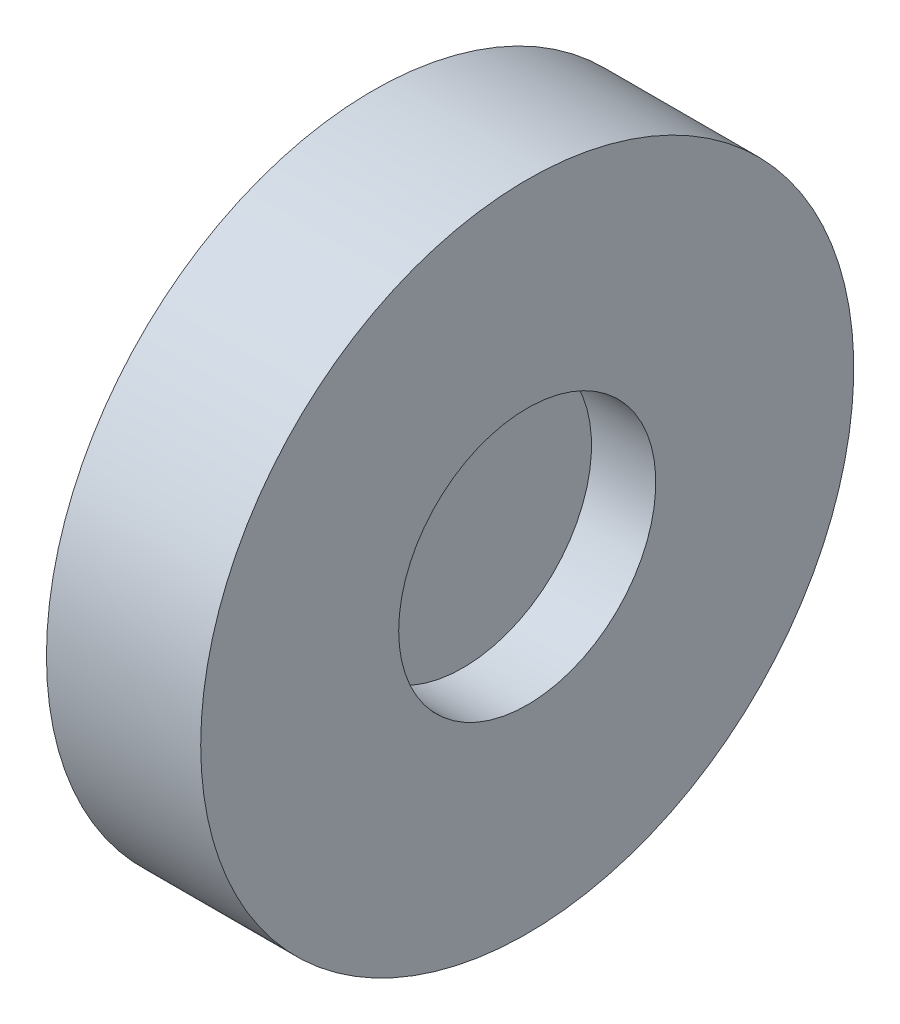
ISO-10303-21;
HEADER;
FILE_DESCRIPTION(('STEP AP214'),'2;1');
FILE_NAME('part.step','',(''),(''),'','','');
FILE_SCHEMA(('AUTOMOTIVE_DESIGN { 1 0 10303 214 1 1 1 1 }'));
ENDSEC;
DATA;
#1=APPLICATION_CONTEXT('core data for automotive mechanical design processes');
#2=APPLICATION_PROTOCOL_DEFINITION('international standard','automotive_design',2000,#1);
#3=PRODUCT_CONTEXT('',#1,'mechanical');
#4=PRODUCT('Part','Part','',(#3));
#5=PRODUCT_RELATED_PRODUCT_CATEGORY('part','',(#4));
#6=PRODUCT_DEFINITION_FORMATION('','',#4);
#7=PRODUCT_DEFINITION_CONTEXT('part definition',#1,'design');
#8=PRODUCT_DEFINITION('design','',#6,#7);
#9=PRODUCT_DEFINITION_SHAPE('','',#8);
#10=(LENGTH_UNIT() NAMED_UNIT(*) SI_UNIT(.MILLI.,.METRE.));
#11=(NAMED_UNIT(*) PLANE_ANGLE_UNIT() SI_UNIT($,.RADIAN.));
#12=(NAMED_UNIT(*) SI_UNIT($,.STERADIAN.) SOLID_ANGLE_UNIT());
#13=UNCERTAINTY_MEASURE_WITH_UNIT(LENGTH_MEASURE(1.E-05),#10,'distance_accuracy_value','');
#14=(GEOMETRIC_REPRESENTATION_CONTEXT(3) GLOBAL_UNCERTAINTY_ASSIGNED_CONTEXT((#13)) GLOBAL_UNIT_ASSIGNED_CONTEXT((#10,
#11,#12)) REPRESENTATION_CONTEXT('',''));
#15=CARTESIAN_POINT('',(0.,0.,0.));
#16=DIRECTION('',(0.,0.,1.));
#17=DIRECTION('',(1.,0.,0.));
#18=AXIS2_PLACEMENT_3D('',#15,#16,#17);
#19=CARTESIAN_POINT('',(0.5,5.,0.));
#20=DIRECTION('',(-1.,0.,0.));
#21=DIRECTION('',(0.,0.,1.));
#22=AXIS2_PLACEMENT_3D('',#19,#20,#21);
#23=PLANE('',#22);
#24=CARTESIAN_POINT('',(0.5,0.,0.));
#25=DIRECTION('',(-1.,0.,0.));
#26=DIRECTION('',(0.,0.,1.));
#27=AXIS2_PLACEMENT_3D('',#24,#25,#26);
#28=CIRCLE('',#27,5.);
#29=CARTESIAN_POINT('',(0.5,0.,5.));
#30=VERTEX_POINT('',#29);
#31=EDGE_CURVE('E10',#30,#30,#28,.T.);
#32=ORIENTED_EDGE('',*,*,#31,.F.);
#33=EDGE_LOOP('',(#32));
#34=FACE_BOUND('',#33,.T.);
#35=ADVANCED_FACE('F37',(#34),#23,.F.);
#36=CARTESIAN_POINT('',(-1.61421241885762,0.,0.));
#37=DIRECTION('',(-1.,0.,0.));
#38=DIRECTION('',(0.,0.,1.));
#39=AXIS2_PLACEMENT_3D('',#36,#37,#38);
#40=CYLINDRICAL_SURFACE('',#39,5.);
#41=CARTESIAN_POINT('',(3.,0.,0.));
#42=DIRECTION('',(-1.,0.,0.));
#43=DIRECTION('',(0.,0.,1.));
#44=AXIS2_PLACEMENT_3D('',#41,#42,#43);
#45=CIRCLE('',#44,5.);
#46=CARTESIAN_POINT('',(3.,0.,5.));
#47=VERTEX_POINT('',#46);
#48=EDGE_CURVE('E60',#47,#47,#45,.T.);
#49=ORIENTED_EDGE('',*,*,#48,.F.);
#50=EDGE_LOOP('',(#49));
#51=FACE_BOUND('',#50,.T.);
#52=ORIENTED_EDGE('',*,*,#31,.T.);
#53=EDGE_LOOP('',(#52));
#54=FACE_BOUND('',#53,.T.);
#55=ADVANCED_FACE('F90',(#51,#54),#40,.F.);
#56=CARTESIAN_POINT('',(-3.,0.,0.));
#57=DIRECTION('',(-1.,0.,0.));
#58=DIRECTION('',(0.,0.,1.));
#59=AXIS2_PLACEMENT_3D('',#56,#57,#58);
#60=CIRCLE('',#59,5.);
#61=CARTESIAN_POINT('',(-3.,0.,5.));
#62=VERTEX_POINT('',#61);
#63=EDGE_CURVE('E64',#62,#62,#60,.T.);
#64=ORIENTED_EDGE('',*,*,#63,.T.);
#65=EDGE_LOOP('',(#64));
#66=FACE_BOUND('',#65,.T.);
#67=CARTESIAN_POINT('',(-0.5,0.,0.));
#68=DIRECTION('',(1.,0.,0.));
#69=DIRECTION('',(0.,0.,-1.));
#70=AXIS2_PLACEMENT_3D('',#67,#68,#69);
#71=CIRCLE('',#70,5.);
#72=CARTESIAN_POINT('',(-0.5,0.,-5.));
#73=VERTEX_POINT('',#72);
#74=EDGE_CURVE('E44',#73,#73,#71,.T.);
#75=ORIENTED_EDGE('',*,*,#74,.T.);
#76=EDGE_LOOP('',(#75));
#77=FACE_BOUND('',#76,.T.);
#78=ADVANCED_FACE('F69',(#66,#77),#40,.F.);
#79=CARTESIAN_POINT('',(-3.,5.,0.));
#80=DIRECTION('',(1.,0.,0.));
#81=DIRECTION('',(0.,0.,-1.));
#82=AXIS2_PLACEMENT_3D('',#79,#80,#81);
#83=PLANE('',#82);
#84=ORIENTED_EDGE('',*,*,#63,.F.);
#85=EDGE_LOOP('',(#84));
#86=FACE_BOUND('',#85,.T.);
#87=CARTESIAN_POINT('',(-3.,0.,0.));
#88=DIRECTION('',(-1.,0.,0.));
#89=DIRECTION('',(0.,0.,1.));
#90=AXIS2_PLACEMENT_3D('',#87,#88,#89);
#91=CIRCLE('',#90,12.7);
#92=CARTESIAN_POINT('',(-3.,0.,12.7));
#93=VERTEX_POINT('',#92);
#94=EDGE_CURVE('E49',#93,#93,#91,.T.);
#95=ORIENTED_EDGE('',*,*,#94,.T.);
#96=EDGE_LOOP('',(#95));
#97=FACE_BOUND('',#96,.T.);
#98=ADVANCED_FACE('F71',(#86,#97),#83,.F.);
#99=CARTESIAN_POINT('',(-1.61421241885762,0.,0.));
#100=DIRECTION('',(-1.,0.,0.));
#101=DIRECTION('',(0.,0.,1.));
#102=AXIS2_PLACEMENT_3D('',#99,#100,#101);
#103=CYLINDRICAL_SURFACE('',#102,12.7);
#104=ORIENTED_EDGE('',*,*,#94,.F.);
#105=EDGE_LOOP('',(#104));
#106=FACE_BOUND('',#105,.T.);
#107=CARTESIAN_POINT('',(3.,0.,0.));
#108=DIRECTION('',(-1.,0.,0.));
#109=DIRECTION('',(0.,0.,1.));
#110=AXIS2_PLACEMENT_3D('',#107,#108,#109);
#111=CIRCLE('',#110,12.7);
#112=CARTESIAN_POINT('',(3.,0.,12.7));
#113=VERTEX_POINT('',#112);
#114=EDGE_CURVE('E54',#113,#113,#111,.T.);
#115=ORIENTED_EDGE('',*,*,#114,.T.);
#116=EDGE_LOOP('',(#115));
#117=FACE_BOUND('',#116,.T.);
#118=ADVANCED_FACE('F74',(#106,#117),#103,.T.);
#119=CARTESIAN_POINT('',(3.,12.7,0.));
#120=DIRECTION('',(-1.,0.,0.));
#121=DIRECTION('',(0.,0.,1.));
#122=AXIS2_PLACEMENT_3D('',#119,#120,#121);
#123=PLANE('',#122);
#124=ORIENTED_EDGE('',*,*,#114,.F.);
#125=EDGE_LOOP('',(#124));
#126=FACE_BOUND('',#125,.T.);
#127=ORIENTED_EDGE('',*,*,#48,.T.);
#128=EDGE_LOOP('',(#127));
#129=FACE_BOUND('',#128,.T.);
#130=ADVANCED_FACE('F80',(#126,#129),#123,.F.);
#131=CARTESIAN_POINT('',(-0.5,5.,0.));
#132=DIRECTION('',(1.,0.,0.));
#133=DIRECTION('',(0.,0.,-1.));
#134=AXIS2_PLACEMENT_3D('',#131,#132,#133);
#135=PLANE('',#134);
#136=ORIENTED_EDGE('',*,*,#74,.F.);
#137=EDGE_LOOP('',(#136));
#138=FACE_BOUND('',#137,.T.);
#139=ADVANCED_FACE('F86',(#138),#135,.F.);
#140=CLOSED_SHELL('',(#35,#55,#78,#98,#118,#130,#139));
#141=MANIFOLD_SOLID_BREP('B2',#140);
#142=ADVANCED_BREP_SHAPE_REPRESENTATION('',(#18,#141),#14);
#143=SHAPE_DEFINITION_REPRESENTATION(#9,#142);
ENDSEC;
END-ISO-10303-21;
